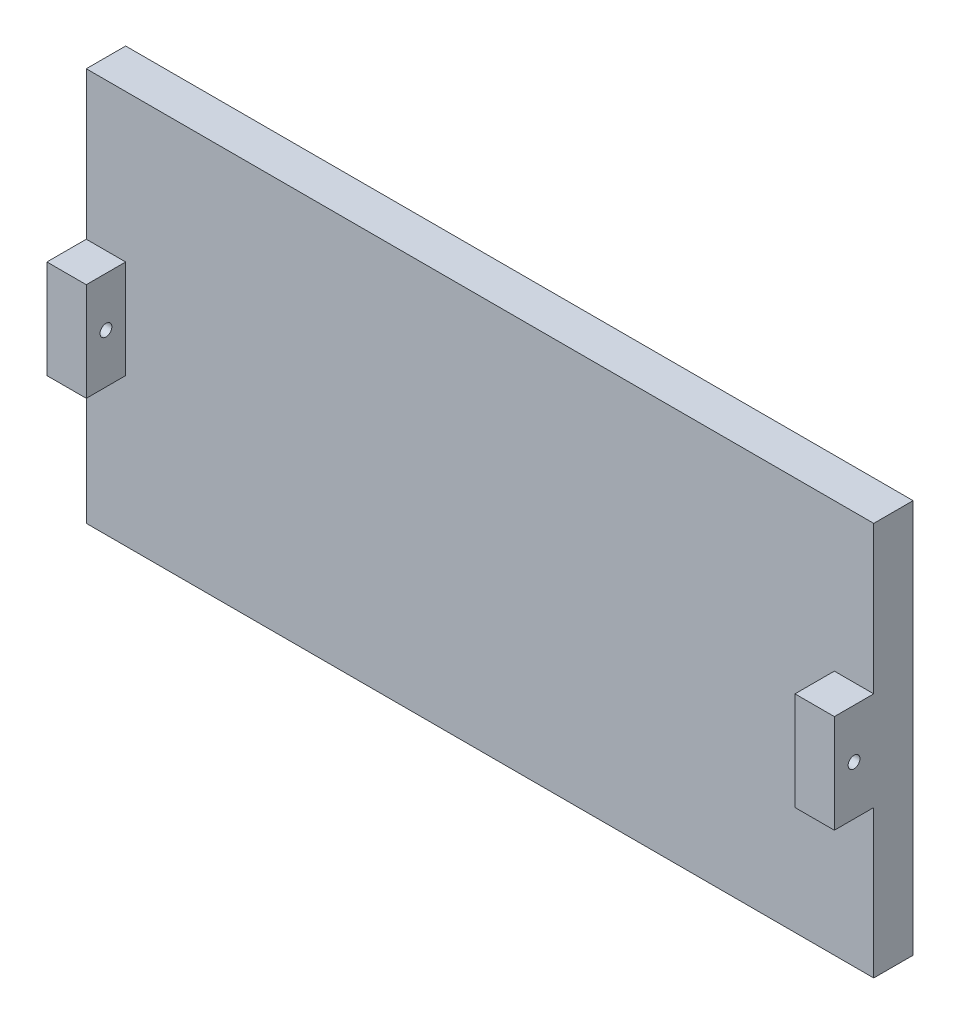
ISO-10303-21;
HEADER;
FILE_DESCRIPTION(('STEP AP214'),'2;1');
FILE_NAME('part.step','',(''),(''),'','','');
FILE_SCHEMA(('AUTOMOTIVE_DESIGN { 1 0 10303 214 1 1 1 1 }'));
ENDSEC;
DATA;
#1=APPLICATION_CONTEXT('core data for automotive mechanical design processes');
#2=APPLICATION_PROTOCOL_DEFINITION('international standard','automotive_design',2000,#1);
#3=PRODUCT_CONTEXT('',#1,'mechanical');
#4=PRODUCT('Part','Part','',(#3));
#5=PRODUCT_RELATED_PRODUCT_CATEGORY('part','',(#4));
#6=PRODUCT_DEFINITION_FORMATION('','',#4);
#7=PRODUCT_DEFINITION_CONTEXT('part definition',#1,'design');
#8=PRODUCT_DEFINITION('design','',#6,#7);
#9=PRODUCT_DEFINITION_SHAPE('','',#8);
#10=(LENGTH_UNIT() NAMED_UNIT(*) SI_UNIT(.MILLI.,.METRE.));
#11=(NAMED_UNIT(*) PLANE_ANGLE_UNIT() SI_UNIT($,.RADIAN.));
#12=(NAMED_UNIT(*) SI_UNIT($,.STERADIAN.) SOLID_ANGLE_UNIT());
#13=UNCERTAINTY_MEASURE_WITH_UNIT(LENGTH_MEASURE(1.E-05),#10,'distance_accuracy_value','');
#14=(GEOMETRIC_REPRESENTATION_CONTEXT(3) GLOBAL_UNCERTAINTY_ASSIGNED_CONTEXT((#13)) GLOBAL_UNIT_ASSIGNED_CONTEXT((#10,
#11,#12)) REPRESENTATION_CONTEXT('',''));
#15=CARTESIAN_POINT('',(0.,0.,0.));
#16=DIRECTION('',(0.,0.,1.));
#17=DIRECTION('',(1.,0.,0.));
#18=AXIS2_PLACEMENT_3D('',#15,#16,#17);
#19=CARTESIAN_POINT('',(0.,0.,10.));
#20=DIRECTION('',(0.,0.,1.));
#21=DIRECTION('',(1.,0.,0.));
#22=AXIS2_PLACEMENT_3D('',#19,#20,#21);
#23=PLANE('',#22);
#24=DIRECTION('',(0.,-1.,0.));
#25=VECTOR('',#24,1.);
#26=CARTESIAN_POINT('',(-10.,62.5,10.));
#27=LINE('',#26,#25);
#28=CARTESIAN_POINT('',(-10.,62.5,10.));
#29=VERTEX_POINT('',#28);
#30=CARTESIAN_POINT('',(-10.,37.5,10.));
#31=VERTEX_POINT('',#30);
#32=EDGE_CURVE('E240',#29,#31,#27,.T.);
#33=ORIENTED_EDGE('',*,*,#32,.F.);
#34=DIRECTION('',(-1.,0.,0.));
#35=VECTOR('',#34,1.);
#36=CARTESIAN_POINT('',(0.,62.5,10.));
#37=LINE('',#36,#35);
#38=CARTESIAN_POINT('',(0.,62.5,10.));
#39=VERTEX_POINT('',#38);
#40=EDGE_CURVE('E242',#39,#29,#37,.T.);
#41=ORIENTED_EDGE('',*,*,#40,.F.);
#42=DIRECTION('',(0.,1.,0.));
#43=VECTOR('',#42,1.);
#44=CARTESIAN_POINT('',(0.,100.,10.));
#45=LINE('',#44,#43);
#46=CARTESIAN_POINT('',(0.,100.,10.));
#47=VERTEX_POINT('',#46);
#48=EDGE_CURVE('E148',#39,#47,#45,.T.);
#49=ORIENTED_EDGE('',*,*,#48,.T.);
#50=DIRECTION('',(-1.,0.,0.));
#51=VECTOR('',#50,1.);
#52=CARTESIAN_POINT('',(-200.,100.,10.));
#53=LINE('',#52,#51);
#54=CARTESIAN_POINT('',(-200.,100.,10.));
#55=VERTEX_POINT('',#54);
#56=EDGE_CURVE('E214',#47,#55,#53,.T.);
#57=ORIENTED_EDGE('',*,*,#56,.T.);
#58=DIRECTION('',(0.,-1.,0.));
#59=VECTOR('',#58,1.);
#60=CARTESIAN_POINT('',(-200.,100.,10.));
#61=LINE('',#60,#59);
#62=CARTESIAN_POINT('',(-200.,62.5,10.));
#63=VERTEX_POINT('',#62);
#64=EDGE_CURVE('E204',#55,#63,#61,.T.);
#65=ORIENTED_EDGE('',*,*,#64,.T.);
#66=DIRECTION('',(-1.,0.,0.));
#67=VECTOR('',#66,1.);
#68=CARTESIAN_POINT('',(-200.,62.5,10.));
#69=LINE('',#68,#67);
#70=CARTESIAN_POINT('',(-190.,62.5,10.));
#71=VERTEX_POINT('',#70);
#72=EDGE_CURVE('E58',#71,#63,#69,.T.);
#73=ORIENTED_EDGE('',*,*,#72,.F.);
#74=DIRECTION('',(0.,1.,0.));
#75=VECTOR('',#74,1.);
#76=CARTESIAN_POINT('',(-190.,62.5,10.));
#77=LINE('',#76,#75);
#78=CARTESIAN_POINT('',(-190.,37.5,10.));
#79=VERTEX_POINT('',#78);
#80=EDGE_CURVE('E152',#79,#71,#77,.T.);
#81=ORIENTED_EDGE('',*,*,#80,.F.);
#82=DIRECTION('',(1.,0.,0.));
#83=VECTOR('',#82,1.);
#84=CARTESIAN_POINT('',(-200.,37.5,10.));
#85=LINE('',#84,#83);
#86=CARTESIAN_POINT('',(-200.,37.5,10.));
#87=VERTEX_POINT('',#86);
#88=EDGE_CURVE('E149',#87,#79,#85,.T.);
#89=ORIENTED_EDGE('',*,*,#88,.F.);
#90=CARTESIAN_POINT('',(-200.,0.,10.));
#91=VERTEX_POINT('',#90);
#92=EDGE_CURVE('E202',#87,#91,#61,.T.);
#93=ORIENTED_EDGE('',*,*,#92,.T.);
#94=DIRECTION('',(1.,0.,0.));
#95=VECTOR('',#94,1.);
#96=CARTESIAN_POINT('',(-200.,0.,10.));
#97=LINE('',#96,#95);
#98=CARTESIAN_POINT('',(0.,0.,10.));
#99=VERTEX_POINT('',#98);
#100=EDGE_CURVE('E198',#91,#99,#97,.T.);
#101=ORIENTED_EDGE('',*,*,#100,.T.);
#102=CARTESIAN_POINT('',(0.,37.5,10.));
#103=VERTEX_POINT('',#102);
#104=EDGE_CURVE('E223',#99,#103,#45,.T.);
#105=ORIENTED_EDGE('',*,*,#104,.T.);
#106=DIRECTION('',(1.,0.,0.));
#107=VECTOR('',#106,1.);
#108=CARTESIAN_POINT('',(0.,37.5,10.));
#109=LINE('',#108,#107);
#110=EDGE_CURVE('E143',#31,#103,#109,.T.);
#111=ORIENTED_EDGE('',*,*,#110,.F.);
#112=EDGE_LOOP('',(#33,#41,#49,#57,#65,#73,#81,#89,#93,#101,#105,#111));
#113=FACE_BOUND('',#112,.T.);
#114=ADVANCED_FACE('F33',(#113),#23,.T.);
#115=CARTESIAN_POINT('',(-200.,100.,10.));
#116=DIRECTION('',(1.,0.,0.));
#117=DIRECTION('',(0.,1.,0.));
#118=AXIS2_PLACEMENT_3D('',#115,#116,#117);
#119=PLANE('',#118);
#120=CARTESIAN_POINT('',(-200.,50.,15.));
#121=DIRECTION('',(-1.,0.,0.));
#122=DIRECTION('',(0.,-1.,0.));
#123=AXIS2_PLACEMENT_3D('',#120,#121,#122);
#124=CIRCLE('',#123,1.5);
#125=CARTESIAN_POINT('',(-200.,48.5,15.));
#126=VERTEX_POINT('',#125);
#127=EDGE_CURVE('E248',#126,#126,#124,.T.);
#128=ORIENTED_EDGE('',*,*,#127,.F.);
#129=EDGE_LOOP('',(#128));
#130=FACE_BOUND('',#129,.T.);
#131=DIRECTION('',(0.,-1.,0.));
#132=VECTOR('',#131,1.);
#133=CARTESIAN_POINT('',(-200.,100.,0.));
#134=LINE('',#133,#132);
#135=CARTESIAN_POINT('',(-200.,100.,0.));
#136=VERTEX_POINT('',#135);
#137=CARTESIAN_POINT('',(-200.,0.,0.));
#138=VERTEX_POINT('',#137);
#139=EDGE_CURVE('E194',#136,#138,#134,.T.);
#140=ORIENTED_EDGE('',*,*,#139,.T.);
#141=DIRECTION('',(0.,0.,-1.));
#142=VECTOR('',#141,1.);
#143=CARTESIAN_POINT('',(-200.,0.,10.));
#144=LINE('',#143,#142);
#145=EDGE_CURVE('E11',#91,#138,#144,.T.);
#146=ORIENTED_EDGE('',*,*,#145,.F.);
#147=ORIENTED_EDGE('',*,*,#92,.F.);
#148=DIRECTION('',(0.,0.,-1.));
#149=VECTOR('',#148,1.);
#150=CARTESIAN_POINT('',(-200.,37.5,20.));
#151=LINE('',#150,#149);
#152=CARTESIAN_POINT('',(-200.,37.5,20.));
#153=VERTEX_POINT('',#152);
#154=EDGE_CURVE('E189',#153,#87,#151,.T.);
#155=ORIENTED_EDGE('',*,*,#154,.F.);
#156=DIRECTION('',(0.,-1.,0.));
#157=VECTOR('',#156,1.);
#158=CARTESIAN_POINT('',(-200.,62.5,20.));
#159=LINE('',#158,#157);
#160=CARTESIAN_POINT('',(-200.,62.5,20.));
#161=VERTEX_POINT('',#160);
#162=EDGE_CURVE('E157',#161,#153,#159,.T.);
#163=ORIENTED_EDGE('',*,*,#162,.F.);
#164=DIRECTION('',(0.,0.,-1.));
#165=VECTOR('',#164,1.);
#166=CARTESIAN_POINT('',(-200.,62.5,20.));
#167=LINE('',#166,#165);
#168=EDGE_CURVE('E166',#161,#63,#167,.T.);
#169=ORIENTED_EDGE('',*,*,#168,.T.);
#170=ORIENTED_EDGE('',*,*,#64,.F.);
#171=DIRECTION('',(0.,0.,-1.));
#172=VECTOR('',#171,1.);
#173=CARTESIAN_POINT('',(-200.,100.,10.));
#174=LINE('',#173,#172);
#175=EDGE_CURVE('E211',#55,#136,#174,.T.);
#176=ORIENTED_EDGE('',*,*,#175,.T.);
#177=EDGE_LOOP('',(#140,#146,#147,#155,#163,#169,#170,#176));
#178=FACE_BOUND('',#177,.T.);
#179=ADVANCED_FACE('F35',(#130,#178),#119,.F.);
#180=CARTESIAN_POINT('',(-200.,0.,10.));
#181=DIRECTION('',(0.,1.,0.));
#182=DIRECTION('',(0.,0.,1.));
#183=AXIS2_PLACEMENT_3D('',#180,#181,#182);
#184=PLANE('',#183);
#185=DIRECTION('',(1.,0.,0.));
#186=VECTOR('',#185,1.);
#187=CARTESIAN_POINT('',(-200.,0.,0.));
#188=LINE('',#187,#186);
#189=CARTESIAN_POINT('',(0.,0.,0.));
#190=VERTEX_POINT('',#189);
#191=EDGE_CURVE('E219',#138,#190,#188,.T.);
#192=ORIENTED_EDGE('',*,*,#191,.T.);
#193=DIRECTION('',(0.,0.,-1.));
#194=VECTOR('',#193,1.);
#195=CARTESIAN_POINT('',(0.,0.,10.));
#196=LINE('',#195,#194);
#197=EDGE_CURVE('E42',#99,#190,#196,.T.);
#198=ORIENTED_EDGE('',*,*,#197,.F.);
#199=ORIENTED_EDGE('',*,*,#100,.F.);
#200=ORIENTED_EDGE('',*,*,#145,.T.);
#201=EDGE_LOOP('',(#192,#198,#199,#200));
#202=FACE_BOUND('',#201,.T.);
#203=ADVANCED_FACE('F233',(#202),#184,.F.);
#204=CARTESIAN_POINT('',(0.,100.,10.));
#205=DIRECTION('',(-1.,0.,0.));
#206=DIRECTION('',(0.,-1.,0.));
#207=AXIS2_PLACEMENT_3D('',#204,#205,#206);
#208=PLANE('',#207);
#209=CARTESIAN_POINT('',(0.,50.0000000000001,15.));
#210=DIRECTION('',(-1.,0.,0.));
#211=DIRECTION('',(0.,-1.,0.));
#212=AXIS2_PLACEMENT_3D('',#209,#210,#211);
#213=CIRCLE('',#212,1.5);
#214=CARTESIAN_POINT('',(0.,48.5000000000001,15.));
#215=VERTEX_POINT('',#214);
#216=EDGE_CURVE('E251',#215,#215,#213,.T.);
#217=ORIENTED_EDGE('',*,*,#216,.T.);
#218=EDGE_LOOP('',(#217));
#219=FACE_BOUND('',#218,.T.);
#220=DIRECTION('',(0.,1.,0.));
#221=VECTOR('',#220,1.);
#222=CARTESIAN_POINT('',(0.,100.,0.));
#223=LINE('',#222,#221);
#224=CARTESIAN_POINT('',(0.,100.,0.));
#225=VERTEX_POINT('',#224);
#226=EDGE_CURVE('E217',#190,#225,#223,.T.);
#227=ORIENTED_EDGE('',*,*,#226,.T.);
#228=DIRECTION('',(0.,0.,-1.));
#229=VECTOR('',#228,1.);
#230=CARTESIAN_POINT('',(0.,100.,10.));
#231=LINE('',#230,#229);
#232=EDGE_CURVE('E208',#47,#225,#231,.T.);
#233=ORIENTED_EDGE('',*,*,#232,.F.);
#234=ORIENTED_EDGE('',*,*,#48,.F.);
#235=DIRECTION('',(0.,0.,-1.));
#236=VECTOR('',#235,1.);
#237=CARTESIAN_POINT('',(0.,62.5,20.));
#238=LINE('',#237,#236);
#239=CARTESIAN_POINT('',(0.,62.5,20.));
#240=VERTEX_POINT('',#239);
#241=EDGE_CURVE('E128',#240,#39,#238,.T.);
#242=ORIENTED_EDGE('',*,*,#241,.F.);
#243=DIRECTION('',(0.,1.,0.));
#244=VECTOR('',#243,1.);
#245=CARTESIAN_POINT('',(0.,62.5,20.));
#246=LINE('',#245,#244);
#247=CARTESIAN_POINT('',(0.,37.5,20.));
#248=VERTEX_POINT('',#247);
#249=EDGE_CURVE('E135',#248,#240,#246,.T.);
#250=ORIENTED_EDGE('',*,*,#249,.F.);
#251=DIRECTION('',(0.,0.,-1.));
#252=VECTOR('',#251,1.);
#253=CARTESIAN_POINT('',(0.,37.5,20.));
#254=LINE('',#253,#252);
#255=EDGE_CURVE('E235',#248,#103,#254,.T.);
#256=ORIENTED_EDGE('',*,*,#255,.T.);
#257=ORIENTED_EDGE('',*,*,#104,.F.);
#258=ORIENTED_EDGE('',*,*,#197,.T.);
#259=EDGE_LOOP('',(#227,#233,#234,#242,#250,#256,#257,#258));
#260=FACE_BOUND('',#259,.T.);
#261=ADVANCED_FACE('F146',(#219,#260),#208,.F.);
#262=CARTESIAN_POINT('',(-200.,100.,10.));
#263=DIRECTION('',(0.,-1.,0.));
#264=DIRECTION('',(0.,0.,-1.));
#265=AXIS2_PLACEMENT_3D('',#262,#263,#264);
#266=PLANE('',#265);
#267=DIRECTION('',(-1.,0.,0.));
#268=VECTOR('',#267,1.);
#269=CARTESIAN_POINT('',(-200.,100.,0.));
#270=LINE('',#269,#268);
#271=EDGE_CURVE('E215',#225,#136,#270,.T.);
#272=ORIENTED_EDGE('',*,*,#271,.T.);
#273=ORIENTED_EDGE('',*,*,#175,.F.);
#274=ORIENTED_EDGE('',*,*,#56,.F.);
#275=ORIENTED_EDGE('',*,*,#232,.T.);
#276=EDGE_LOOP('',(#272,#273,#274,#275));
#277=FACE_BOUND('',#276,.T.);
#278=ADVANCED_FACE('F286',(#277),#266,.F.);
#279=CARTESIAN_POINT('',(0.,0.,0.));
#280=DIRECTION('',(0.,0.,1.));
#281=DIRECTION('',(1.,0.,0.));
#282=AXIS2_PLACEMENT_3D('',#279,#280,#281);
#283=PLANE('',#282);
#284=ORIENTED_EDGE('',*,*,#139,.F.);
#285=ORIENTED_EDGE('',*,*,#271,.F.);
#286=ORIENTED_EDGE('',*,*,#226,.F.);
#287=ORIENTED_EDGE('',*,*,#191,.F.);
#288=EDGE_LOOP('',(#284,#285,#286,#287));
#289=FACE_BOUND('',#288,.T.);
#290=ADVANCED_FACE('F283',(#289),#283,.F.);
#291=CARTESIAN_POINT('',(-200.,37.5,20.));
#292=DIRECTION('',(0.,1.,0.));
#293=DIRECTION('',(0.,0.,1.));
#294=AXIS2_PLACEMENT_3D('',#291,#292,#293);
#295=PLANE('',#294);
#296=ORIENTED_EDGE('',*,*,#88,.T.);
#297=DIRECTION('',(0.,0.,-1.));
#298=VECTOR('',#297,1.);
#299=CARTESIAN_POINT('',(-190.,37.5,20.));
#300=LINE('',#299,#298);
#301=CARTESIAN_POINT('',(-190.,37.5,20.));
#302=VERTEX_POINT('',#301);
#303=EDGE_CURVE('E184',#302,#79,#300,.T.);
#304=ORIENTED_EDGE('',*,*,#303,.F.);
#305=DIRECTION('',(1.,0.,0.));
#306=VECTOR('',#305,1.);
#307=CARTESIAN_POINT('',(-200.,37.5,20.));
#308=LINE('',#307,#306);
#309=EDGE_CURVE('E160',#153,#302,#308,.T.);
#310=ORIENTED_EDGE('',*,*,#309,.F.);
#311=ORIENTED_EDGE('',*,*,#154,.T.);
#312=EDGE_LOOP('',(#296,#304,#310,#311));
#313=FACE_BOUND('',#312,.T.);
#314=ADVANCED_FACE('F281',(#313),#295,.F.);
#315=CARTESIAN_POINT('',(-190.,62.5,20.));
#316=DIRECTION('',(-1.,0.,0.));
#317=DIRECTION('',(0.,0.,1.));
#318=AXIS2_PLACEMENT_3D('',#315,#316,#317);
#319=PLANE('',#318);
#320=CARTESIAN_POINT('',(-190.,50.,15.));
#321=DIRECTION('',(-1.,0.,0.));
#322=DIRECTION('',(0.,0.,1.));
#323=AXIS2_PLACEMENT_3D('',#320,#321,#322);
#324=CIRCLE('',#323,1.5);
#325=CARTESIAN_POINT('',(-190.,50.,16.5));
#326=VERTEX_POINT('',#325);
#327=EDGE_CURVE('E243',#326,#326,#324,.T.);
#328=ORIENTED_EDGE('',*,*,#327,.T.);
#329=EDGE_LOOP('',(#328));
#330=FACE_BOUND('',#329,.T.);
#331=ORIENTED_EDGE('',*,*,#80,.T.);
#332=DIRECTION('',(0.,0.,-1.));
#333=VECTOR('',#332,1.);
#334=CARTESIAN_POINT('',(-190.,62.5,20.));
#335=LINE('',#334,#333);
#336=CARTESIAN_POINT('',(-190.,62.5,20.));
#337=VERTEX_POINT('',#336);
#338=EDGE_CURVE('E170',#337,#71,#335,.T.);
#339=ORIENTED_EDGE('',*,*,#338,.F.);
#340=DIRECTION('',(0.,1.,0.));
#341=VECTOR('',#340,1.);
#342=CARTESIAN_POINT('',(-190.,62.5,20.));
#343=LINE('',#342,#341);
#344=EDGE_CURVE('E162',#302,#337,#343,.T.);
#345=ORIENTED_EDGE('',*,*,#344,.F.);
#346=ORIENTED_EDGE('',*,*,#303,.T.);
#347=EDGE_LOOP('',(#331,#339,#345,#346));
#348=FACE_BOUND('',#347,.T.);
#349=ADVANCED_FACE('F316',(#330,#348),#319,.F.);
#350=CARTESIAN_POINT('',(-200.,62.5,20.));
#351=DIRECTION('',(0.,-1.,0.));
#352=DIRECTION('',(0.,0.,-1.));
#353=AXIS2_PLACEMENT_3D('',#350,#351,#352);
#354=PLANE('',#353);
#355=ORIENTED_EDGE('',*,*,#72,.T.);
#356=ORIENTED_EDGE('',*,*,#168,.F.);
#357=DIRECTION('',(-1.,0.,0.));
#358=VECTOR('',#357,1.);
#359=CARTESIAN_POINT('',(-200.,62.5,20.));
#360=LINE('',#359,#358);
#361=EDGE_CURVE('E164',#337,#161,#360,.T.);
#362=ORIENTED_EDGE('',*,*,#361,.F.);
#363=ORIENTED_EDGE('',*,*,#338,.T.);
#364=EDGE_LOOP('',(#355,#356,#362,#363));
#365=FACE_BOUND('',#364,.T.);
#366=ADVANCED_FACE('F323',(#365),#354,.F.);
#367=CARTESIAN_POINT('',(0.,0.,20.));
#368=DIRECTION('',(0.,0.,1.));
#369=DIRECTION('',(1.,0.,0.));
#370=AXIS2_PLACEMENT_3D('',#367,#368,#369);
#371=PLANE('',#370);
#372=ORIENTED_EDGE('',*,*,#162,.T.);
#373=ORIENTED_EDGE('',*,*,#309,.T.);
#374=ORIENTED_EDGE('',*,*,#344,.T.);
#375=ORIENTED_EDGE('',*,*,#361,.T.);
#376=EDGE_LOOP('',(#372,#373,#374,#375));
#377=FACE_BOUND('',#376,.T.);
#378=ADVANCED_FACE('F330',(#377),#371,.T.);
#379=CARTESIAN_POINT('',(0.,62.5,20.));
#380=DIRECTION('',(0.,-1.,0.));
#381=DIRECTION('',(0.,0.,-1.));
#382=AXIS2_PLACEMENT_3D('',#379,#380,#381);
#383=PLANE('',#382);
#384=ORIENTED_EDGE('',*,*,#40,.T.);
#385=DIRECTION('',(0.,0.,-1.));
#386=VECTOR('',#385,1.);
#387=CARTESIAN_POINT('',(-10.,62.5,20.));
#388=LINE('',#387,#386);
#389=CARTESIAN_POINT('',(-10.,62.5,20.));
#390=VERTEX_POINT('',#389);
#391=EDGE_CURVE('E131',#390,#29,#388,.T.);
#392=ORIENTED_EDGE('',*,*,#391,.F.);
#393=DIRECTION('',(-1.,0.,0.));
#394=VECTOR('',#393,1.);
#395=CARTESIAN_POINT('',(0.,62.5,20.));
#396=LINE('',#395,#394);
#397=EDGE_CURVE('E124',#240,#390,#396,.T.);
#398=ORIENTED_EDGE('',*,*,#397,.F.);
#399=ORIENTED_EDGE('',*,*,#241,.T.);
#400=EDGE_LOOP('',(#384,#392,#398,#399));
#401=FACE_BOUND('',#400,.T.);
#402=ADVANCED_FACE('F126',(#401),#383,.F.);
#403=CARTESIAN_POINT('',(-10.,62.5,20.));
#404=DIRECTION('',(1.,0.,0.));
#405=DIRECTION('',(0.,0.,-1.));
#406=AXIS2_PLACEMENT_3D('',#403,#404,#405);
#407=PLANE('',#406);
#408=CARTESIAN_POINT('',(-10.,50.0000000000001,15.));
#409=DIRECTION('',(1.,0.,0.));
#410=DIRECTION('',(0.,0.,-1.));
#411=AXIS2_PLACEMENT_3D('',#408,#409,#410);
#412=CIRCLE('',#411,1.5);
#413=CARTESIAN_POINT('',(-10.,50.0000000000001,13.5));
#414=VERTEX_POINT('',#413);
#415=EDGE_CURVE('E37',#414,#414,#412,.T.);
#416=ORIENTED_EDGE('',*,*,#415,.T.);
#417=EDGE_LOOP('',(#416));
#418=FACE_BOUND('',#417,.T.);
#419=ORIENTED_EDGE('',*,*,#32,.T.);
#420=DIRECTION('',(0.,0.,-1.));
#421=VECTOR('',#420,1.);
#422=CARTESIAN_POINT('',(-10.,37.5,20.));
#423=LINE('',#422,#421);
#424=CARTESIAN_POINT('',(-10.,37.5,20.));
#425=VERTEX_POINT('',#424);
#426=EDGE_CURVE('E50',#425,#31,#423,.T.);
#427=ORIENTED_EDGE('',*,*,#426,.F.);
#428=DIRECTION('',(0.,-1.,0.));
#429=VECTOR('',#428,1.);
#430=CARTESIAN_POINT('',(-10.,62.5,20.));
#431=LINE('',#430,#429);
#432=EDGE_CURVE('E134',#390,#425,#431,.T.);
#433=ORIENTED_EDGE('',*,*,#432,.F.);
#434=ORIENTED_EDGE('',*,*,#391,.T.);
#435=EDGE_LOOP('',(#419,#427,#433,#434));
#436=FACE_BOUND('',#435,.T.);
#437=ADVANCED_FACE('F258',(#418,#436),#407,.F.);
#438=CARTESIAN_POINT('',(0.,37.5,20.));
#439=DIRECTION('',(0.,1.,0.));
#440=DIRECTION('',(0.,0.,1.));
#441=AXIS2_PLACEMENT_3D('',#438,#439,#440);
#442=PLANE('',#441);
#443=ORIENTED_EDGE('',*,*,#110,.T.);
#444=ORIENTED_EDGE('',*,*,#255,.F.);
#445=DIRECTION('',(1.,0.,0.));
#446=VECTOR('',#445,1.);
#447=CARTESIAN_POINT('',(0.,37.5,20.));
#448=LINE('',#447,#446);
#449=EDGE_CURVE('E139',#425,#248,#448,.T.);
#450=ORIENTED_EDGE('',*,*,#449,.F.);
#451=ORIENTED_EDGE('',*,*,#426,.T.);
#452=EDGE_LOOP('',(#443,#444,#450,#451));
#453=FACE_BOUND('',#452,.T.);
#454=ADVANCED_FACE('F271',(#453),#442,.F.);
#455=CARTESIAN_POINT('',(0.,0.,20.));
#456=DIRECTION('',(0.,0.,-1.));
#457=DIRECTION('',(-1.,0.,0.));
#458=AXIS2_PLACEMENT_3D('',#455,#456,#457);
#459=PLANE('',#458);
#460=ORIENTED_EDGE('',*,*,#249,.T.);
#461=ORIENTED_EDGE('',*,*,#397,.T.);
#462=ORIENTED_EDGE('',*,*,#432,.T.);
#463=ORIENTED_EDGE('',*,*,#449,.T.);
#464=EDGE_LOOP('',(#460,#461,#462,#463));
#465=FACE_BOUND('',#464,.T.);
#466=ADVANCED_FACE('F138',(#465),#459,.F.);
#467=CARTESIAN_POINT('',(0.,50.0000000000001,15.));
#468=DIRECTION('',(-1.,0.,0.));
#469=DIRECTION('',(0.,-1.,0.));
#470=AXIS2_PLACEMENT_3D('',#467,#468,#469);
#471=CYLINDRICAL_SURFACE('',#470,1.5);
#472=ORIENTED_EDGE('',*,*,#216,.F.);
#473=EDGE_LOOP('',(#472));
#474=FACE_BOUND('',#473,.T.);
#475=ORIENTED_EDGE('',*,*,#415,.F.);
#476=EDGE_LOOP('',(#475));
#477=FACE_BOUND('',#476,.T.);
#478=ADVANCED_FACE('F261',(#474,#477),#471,.F.);
#479=ORIENTED_EDGE('',*,*,#127,.T.);
#480=EDGE_LOOP('',(#479));
#481=FACE_BOUND('',#480,.T.);
#482=ORIENTED_EDGE('',*,*,#327,.F.);
#483=EDGE_LOOP('',(#482));
#484=FACE_BOUND('',#483,.T.);
#485=ADVANCED_FACE('F263',(#481,#484),#471,.F.);
#486=CLOSED_SHELL('',(#114,#179,#203,#261,#278,#290,#314,#349,#366,#378,#402,#437,#454,#466,
#478,#485));
#487=MANIFOLD_SOLID_BREP('B2',#486);
#488=ADVANCED_BREP_SHAPE_REPRESENTATION('',(#18,#487),#14);
#489=SHAPE_DEFINITION_REPRESENTATION(#9,#488);
ENDSEC;
END-ISO-10303-21;
